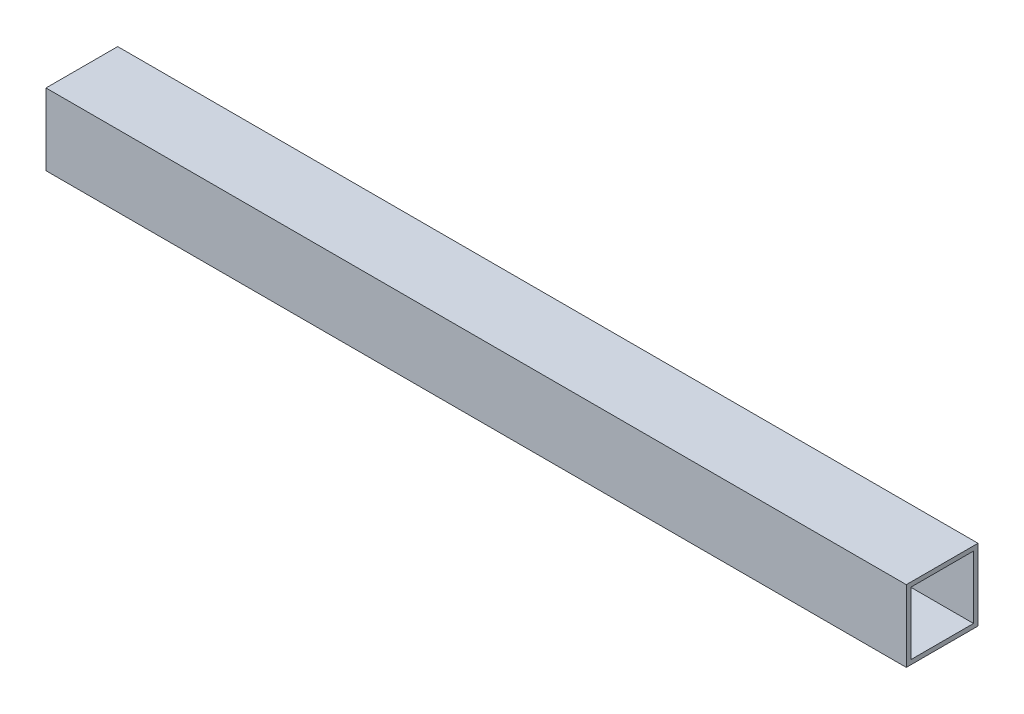
ISO-10303-21;
HEADER;
FILE_DESCRIPTION(('STEP AP214'),'2;1');
FILE_NAME('part.step','',(''),(''),'','','');
FILE_SCHEMA(('AUTOMOTIVE_DESIGN { 1 0 10303 214 1 1 1 1 }'));
ENDSEC;
DATA;
#1=APPLICATION_CONTEXT('core data for automotive mechanical design processes');
#2=APPLICATION_PROTOCOL_DEFINITION('international standard','automotive_design',2000,#1);
#3=PRODUCT_CONTEXT('',#1,'mechanical');
#4=PRODUCT('Part','Part','',(#3));
#5=PRODUCT_RELATED_PRODUCT_CATEGORY('part','',(#4));
#6=PRODUCT_DEFINITION_FORMATION('','',#4);
#7=PRODUCT_DEFINITION_CONTEXT('part definition',#1,'design');
#8=PRODUCT_DEFINITION('design','',#6,#7);
#9=PRODUCT_DEFINITION_SHAPE('','',#8);
#10=(LENGTH_UNIT() NAMED_UNIT(*) SI_UNIT(.MILLI.,.METRE.));
#11=(NAMED_UNIT(*) PLANE_ANGLE_UNIT() SI_UNIT($,.RADIAN.));
#12=(NAMED_UNIT(*) SI_UNIT($,.STERADIAN.) SOLID_ANGLE_UNIT());
#13=UNCERTAINTY_MEASURE_WITH_UNIT(LENGTH_MEASURE(1.E-05),#10,'distance_accuracy_value','');
#14=(GEOMETRIC_REPRESENTATION_CONTEXT(3) GLOBAL_UNCERTAINTY_ASSIGNED_CONTEXT((#13)) GLOBAL_UNIT_ASSIGNED_CONTEXT((#10,
#11,#12)) REPRESENTATION_CONTEXT('',''));
#15=CARTESIAN_POINT('',(0.,0.,0.));
#16=DIRECTION('',(0.,0.,1.));
#17=DIRECTION('',(1.,0.,0.));
#18=AXIS2_PLACEMENT_3D('',#15,#16,#17);
#19=CARTESIAN_POINT('',(304.8,0.,0.));
#20=DIRECTION('',(1.,0.,0.));
#21=DIRECTION('',(0.,0.,-1.));
#22=AXIS2_PLACEMENT_3D('',#19,#20,#21);
#23=PLANE('',#22);
#24=DIRECTION('',(0.,1.,0.));
#25=VECTOR('',#24,1.);
#26=CARTESIAN_POINT('',(304.8,12.7,-12.7));
#27=LINE('',#26,#25);
#28=CARTESIAN_POINT('',(304.8,-12.7,-12.7));
#29=VERTEX_POINT('',#28);
#30=CARTESIAN_POINT('',(304.8,12.7,-12.7));
#31=VERTEX_POINT('',#30);
#32=EDGE_CURVE('E177',#29,#31,#27,.T.);
#33=ORIENTED_EDGE('',*,*,#32,.T.);
#34=DIRECTION('',(0.,0.,1.));
#35=VECTOR('',#34,1.);
#36=CARTESIAN_POINT('',(304.8,12.7,12.7));
#37=LINE('',#36,#35);
#38=CARTESIAN_POINT('',(304.8,12.7,12.7));
#39=VERTEX_POINT('',#38);
#40=EDGE_CURVE('E181',#31,#39,#37,.T.);
#41=ORIENTED_EDGE('',*,*,#40,.T.);
#42=DIRECTION('',(0.,-1.,0.));
#43=VECTOR('',#42,1.);
#44=CARTESIAN_POINT('',(304.8,12.7,12.7));
#45=LINE('',#44,#43);
#46=CARTESIAN_POINT('',(304.8,-12.7,12.7));
#47=VERTEX_POINT('',#46);
#48=EDGE_CURVE('E185',#39,#47,#45,.T.);
#49=ORIENTED_EDGE('',*,*,#48,.T.);
#50=DIRECTION('',(0.,0.,-1.));
#51=VECTOR('',#50,1.);
#52=CARTESIAN_POINT('',(304.8,-12.7,12.7));
#53=LINE('',#52,#51);
#54=EDGE_CURVE('E188',#47,#29,#53,.T.);
#55=ORIENTED_EDGE('',*,*,#54,.T.);
#56=EDGE_LOOP('',(#33,#41,#49,#55));
#57=FACE_BOUND('',#56,.T.);
#58=DIRECTION('',(0.,0.,1.));
#59=VECTOR('',#58,1.);
#60=CARTESIAN_POINT('',(304.8,11.1125,12.7));
#61=LINE('',#60,#59);
#62=CARTESIAN_POINT('',(304.8,11.1125,-11.1125));
#63=VERTEX_POINT('',#62);
#64=CARTESIAN_POINT('',(304.8,11.1125,11.1125));
#65=VERTEX_POINT('',#64);
#66=EDGE_CURVE('E138',#63,#65,#61,.T.);
#67=ORIENTED_EDGE('',*,*,#66,.F.);
#68=DIRECTION('',(0.,1.,0.));
#69=VECTOR('',#68,1.);
#70=CARTESIAN_POINT('',(304.8,12.7,-11.1125));
#71=LINE('',#70,#69);
#72=CARTESIAN_POINT('',(304.8,-11.1125,-11.1125));
#73=VERTEX_POINT('',#72);
#74=EDGE_CURVE('E129',#73,#63,#71,.T.);
#75=ORIENTED_EDGE('',*,*,#74,.F.);
#76=DIRECTION('',(0.,0.,-1.));
#77=VECTOR('',#76,1.);
#78=CARTESIAN_POINT('',(304.8,-11.1125,12.7));
#79=LINE('',#78,#77);
#80=CARTESIAN_POINT('',(304.8,-11.1125,11.1125));
#81=VERTEX_POINT('',#80);
#82=EDGE_CURVE('E155',#81,#73,#79,.T.);
#83=ORIENTED_EDGE('',*,*,#82,.F.);
#84=DIRECTION('',(0.,-1.,0.));
#85=VECTOR('',#84,1.);
#86=CARTESIAN_POINT('',(304.8,12.7,11.1125));
#87=LINE('',#86,#85);
#88=EDGE_CURVE('E151',#65,#81,#87,.T.);
#89=ORIENTED_EDGE('',*,*,#88,.F.);
#90=EDGE_LOOP('',(#67,#75,#83,#89));
#91=FACE_BOUND('',#90,.T.);
#92=ADVANCED_FACE('F63',(#57,#91),#23,.T.);
#93=CARTESIAN_POINT('',(0.,0.,0.));
#94=DIRECTION('',(1.,0.,0.));
#95=DIRECTION('',(0.,0.,-1.));
#96=AXIS2_PLACEMENT_3D('',#93,#94,#95);
#97=PLANE('',#96);
#98=DIRECTION('',(0.,1.,0.));
#99=VECTOR('',#98,1.);
#100=CARTESIAN_POINT('',(0.,12.7,-12.7));
#101=LINE('',#100,#99);
#102=CARTESIAN_POINT('',(0.,-12.7,-12.7));
#103=VERTEX_POINT('',#102);
#104=CARTESIAN_POINT('',(0.,12.7,-12.7));
#105=VERTEX_POINT('',#104);
#106=EDGE_CURVE('E147',#103,#105,#101,.T.);
#107=ORIENTED_EDGE('',*,*,#106,.F.);
#108=DIRECTION('',(0.,0.,-1.));
#109=VECTOR('',#108,1.);
#110=CARTESIAN_POINT('',(0.,-12.7,12.7));
#111=LINE('',#110,#109);
#112=CARTESIAN_POINT('',(0.,-12.7,12.7));
#113=VERTEX_POINT('',#112);
#114=EDGE_CURVE('E182',#113,#103,#111,.T.);
#115=ORIENTED_EDGE('',*,*,#114,.F.);
#116=DIRECTION('',(0.,-1.,0.));
#117=VECTOR('',#116,1.);
#118=CARTESIAN_POINT('',(0.,12.7,12.7));
#119=LINE('',#118,#117);
#120=CARTESIAN_POINT('',(0.,12.7,12.7));
#121=VERTEX_POINT('',#120);
#122=EDGE_CURVE('E198',#121,#113,#119,.T.);
#123=ORIENTED_EDGE('',*,*,#122,.F.);
#124=DIRECTION('',(0.,0.,1.));
#125=VECTOR('',#124,1.);
#126=CARTESIAN_POINT('',(0.,12.7,12.7));
#127=LINE('',#126,#125);
#128=EDGE_CURVE('E195',#105,#121,#127,.T.);
#129=ORIENTED_EDGE('',*,*,#128,.F.);
#130=EDGE_LOOP('',(#107,#115,#123,#129));
#131=FACE_BOUND('',#130,.T.);
#132=DIRECTION('',(0.,1.,0.));
#133=VECTOR('',#132,1.);
#134=CARTESIAN_POINT('',(0.,12.7,-11.1125));
#135=LINE('',#134,#133);
#136=CARTESIAN_POINT('',(0.,-11.1125,-11.1125));
#137=VERTEX_POINT('',#136);
#138=CARTESIAN_POINT('',(0.,11.1125,-11.1125));
#139=VERTEX_POINT('',#138);
#140=EDGE_CURVE('E87',#137,#139,#135,.T.);
#141=ORIENTED_EDGE('',*,*,#140,.T.);
#142=DIRECTION('',(0.,0.,1.));
#143=VECTOR('',#142,1.);
#144=CARTESIAN_POINT('',(0.,11.1125,12.7));
#145=LINE('',#144,#143);
#146=CARTESIAN_POINT('',(0.,11.1125,11.1125));
#147=VERTEX_POINT('',#146);
#148=EDGE_CURVE('E145',#139,#147,#145,.T.);
#149=ORIENTED_EDGE('',*,*,#148,.T.);
#150=DIRECTION('',(0.,-1.,0.));
#151=VECTOR('',#150,1.);
#152=CARTESIAN_POINT('',(0.,12.7,11.1125));
#153=LINE('',#152,#151);
#154=CARTESIAN_POINT('',(0.,-11.1125,11.1125));
#155=VERTEX_POINT('',#154);
#156=EDGE_CURVE('E164',#147,#155,#153,.T.);
#157=ORIENTED_EDGE('',*,*,#156,.T.);
#158=DIRECTION('',(0.,0.,-1.));
#159=VECTOR('',#158,1.);
#160=CARTESIAN_POINT('',(0.,-11.1125,12.7));
#161=LINE('',#160,#159);
#162=EDGE_CURVE('E139',#155,#137,#161,.T.);
#163=ORIENTED_EDGE('',*,*,#162,.T.);
#164=EDGE_LOOP('',(#141,#149,#157,#163));
#165=FACE_BOUND('',#164,.T.);
#166=ADVANCED_FACE('F221',(#131,#165),#97,.F.);
#167=CARTESIAN_POINT('',(304.8,12.7,-12.7));
#168=DIRECTION('',(0.,0.,1.));
#169=DIRECTION('',(0.,-1.,0.));
#170=AXIS2_PLACEMENT_3D('',#167,#168,#169);
#171=PLANE('',#170);
#172=ORIENTED_EDGE('',*,*,#106,.T.);
#173=DIRECTION('',(-1.,0.,0.));
#174=VECTOR('',#173,1.);
#175=CARTESIAN_POINT('',(304.8,12.7,-12.7));
#176=LINE('',#175,#174);
#177=EDGE_CURVE('E12',#31,#105,#176,.T.);
#178=ORIENTED_EDGE('',*,*,#177,.F.);
#179=ORIENTED_EDGE('',*,*,#32,.F.);
#180=DIRECTION('',(-1.,0.,0.));
#181=VECTOR('',#180,1.);
#182=CARTESIAN_POINT('',(304.8,-12.7,-12.7));
#183=LINE('',#182,#181);
#184=EDGE_CURVE('E191',#29,#103,#183,.T.);
#185=ORIENTED_EDGE('',*,*,#184,.T.);
#186=EDGE_LOOP('',(#172,#178,#179,#185));
#187=FACE_BOUND('',#186,.T.);
#188=ADVANCED_FACE('F65',(#187),#171,.F.);
#189=CARTESIAN_POINT('',(304.8,12.7,12.7));
#190=DIRECTION('',(0.,-1.,0.));
#191=DIRECTION('',(0.,0.,-1.));
#192=AXIS2_PLACEMENT_3D('',#189,#190,#191);
#193=PLANE('',#192);
#194=ORIENTED_EDGE('',*,*,#128,.T.);
#195=DIRECTION('',(-1.,0.,0.));
#196=VECTOR('',#195,1.);
#197=CARTESIAN_POINT('',(304.8,12.7,12.7));
#198=LINE('',#197,#196);
#199=EDGE_CURVE('E72',#39,#121,#198,.T.);
#200=ORIENTED_EDGE('',*,*,#199,.F.);
#201=ORIENTED_EDGE('',*,*,#40,.F.);
#202=ORIENTED_EDGE('',*,*,#177,.T.);
#203=EDGE_LOOP('',(#194,#200,#201,#202));
#204=FACE_BOUND('',#203,.T.);
#205=ADVANCED_FACE('F231',(#204),#193,.F.);
#206=CARTESIAN_POINT('',(304.8,12.7,12.7));
#207=DIRECTION('',(0.,0.,-1.));
#208=DIRECTION('',(0.,1.,0.));
#209=AXIS2_PLACEMENT_3D('',#206,#207,#208);
#210=PLANE('',#209);
#211=ORIENTED_EDGE('',*,*,#122,.T.);
#212=DIRECTION('',(-1.,0.,0.));
#213=VECTOR('',#212,1.);
#214=CARTESIAN_POINT('',(304.8,-12.7,12.7));
#215=LINE('',#214,#213);
#216=EDGE_CURVE('E206',#47,#113,#215,.T.);
#217=ORIENTED_EDGE('',*,*,#216,.F.);
#218=ORIENTED_EDGE('',*,*,#48,.F.);
#219=ORIENTED_EDGE('',*,*,#199,.T.);
#220=EDGE_LOOP('',(#211,#217,#218,#219));
#221=FACE_BOUND('',#220,.T.);
#222=ADVANCED_FACE('F215',(#221),#210,.F.);
#223=CARTESIAN_POINT('',(304.8,-12.7,12.7));
#224=DIRECTION('',(0.,1.,0.));
#225=DIRECTION('',(0.,0.,1.));
#226=AXIS2_PLACEMENT_3D('',#223,#224,#225);
#227=PLANE('',#226);
#228=ORIENTED_EDGE('',*,*,#114,.T.);
#229=ORIENTED_EDGE('',*,*,#184,.F.);
#230=ORIENTED_EDGE('',*,*,#54,.F.);
#231=ORIENTED_EDGE('',*,*,#216,.T.);
#232=EDGE_LOOP('',(#228,#229,#230,#231));
#233=FACE_BOUND('',#232,.T.);
#234=ADVANCED_FACE('F225',(#233),#227,.F.);
#235=CARTESIAN_POINT('',(304.8,12.7,-11.1125));
#236=DIRECTION('',(0.,0.,1.));
#237=DIRECTION('',(0.,-1.,0.));
#238=AXIS2_PLACEMENT_3D('',#235,#236,#237);
#239=PLANE('',#238);
#240=ORIENTED_EDGE('',*,*,#140,.F.);
#241=DIRECTION('',(-1.,0.,0.));
#242=VECTOR('',#241,1.);
#243=CARTESIAN_POINT('',(304.8,-11.1125,-11.1125));
#244=LINE('',#243,#242);
#245=EDGE_CURVE('E133',#73,#137,#244,.T.);
#246=ORIENTED_EDGE('',*,*,#245,.F.);
#247=ORIENTED_EDGE('',*,*,#74,.T.);
#248=DIRECTION('',(-1.,0.,0.));
#249=VECTOR('',#248,1.);
#250=CARTESIAN_POINT('',(304.8,11.1125,-11.1125));
#251=LINE('',#250,#249);
#252=EDGE_CURVE('E132',#63,#139,#251,.T.);
#253=ORIENTED_EDGE('',*,*,#252,.T.);
#254=EDGE_LOOP('',(#240,#246,#247,#253));
#255=FACE_BOUND('',#254,.T.);
#256=ADVANCED_FACE('F131',(#255),#239,.T.);
#257=CARTESIAN_POINT('',(304.8,11.1125,12.7));
#258=DIRECTION('',(0.,-1.,0.));
#259=DIRECTION('',(0.,0.,-1.));
#260=AXIS2_PLACEMENT_3D('',#257,#258,#259);
#261=PLANE('',#260);
#262=ORIENTED_EDGE('',*,*,#148,.F.);
#263=ORIENTED_EDGE('',*,*,#252,.F.);
#264=ORIENTED_EDGE('',*,*,#66,.T.);
#265=DIRECTION('',(-1.,0.,0.));
#266=VECTOR('',#265,1.);
#267=CARTESIAN_POINT('',(304.8,11.1125,11.1125));
#268=LINE('',#267,#266);
#269=EDGE_CURVE('E148',#65,#147,#268,.T.);
#270=ORIENTED_EDGE('',*,*,#269,.T.);
#271=EDGE_LOOP('',(#262,#263,#264,#270));
#272=FACE_BOUND('',#271,.T.);
#273=ADVANCED_FACE('F142',(#272),#261,.T.);
#274=CARTESIAN_POINT('',(304.8,12.7,11.1125));
#275=DIRECTION('',(0.,0.,-1.));
#276=DIRECTION('',(0.,1.,0.));
#277=AXIS2_PLACEMENT_3D('',#274,#275,#276);
#278=PLANE('',#277);
#279=ORIENTED_EDGE('',*,*,#156,.F.);
#280=ORIENTED_EDGE('',*,*,#269,.F.);
#281=ORIENTED_EDGE('',*,*,#88,.T.);
#282=DIRECTION('',(-1.,0.,0.));
#283=VECTOR('',#282,1.);
#284=CARTESIAN_POINT('',(304.8,-11.1125,11.1125));
#285=LINE('',#284,#283);
#286=EDGE_CURVE('E79',#81,#155,#285,.T.);
#287=ORIENTED_EDGE('',*,*,#286,.T.);
#288=EDGE_LOOP('',(#279,#280,#281,#287));
#289=FACE_BOUND('',#288,.T.);
#290=ADVANCED_FACE('F254',(#289),#278,.T.);
#291=CARTESIAN_POINT('',(304.8,-11.1125,12.7));
#292=DIRECTION('',(0.,1.,0.));
#293=DIRECTION('',(0.,0.,1.));
#294=AXIS2_PLACEMENT_3D('',#291,#292,#293);
#295=PLANE('',#294);
#296=ORIENTED_EDGE('',*,*,#162,.F.);
#297=ORIENTED_EDGE('',*,*,#286,.F.);
#298=ORIENTED_EDGE('',*,*,#82,.T.);
#299=ORIENTED_EDGE('',*,*,#245,.T.);
#300=EDGE_LOOP('',(#296,#297,#298,#299));
#301=FACE_BOUND('',#300,.T.);
#302=ADVANCED_FACE('F258',(#301),#295,.T.);
#303=CLOSED_SHELL('',(#92,#166,#188,#205,#222,#234,#256,#273,#290,#302));
#304=MANIFOLD_SOLID_BREP('B2',#303);
#305=ADVANCED_BREP_SHAPE_REPRESENTATION('',(#18,#304),#14);
#306=SHAPE_DEFINITION_REPRESENTATION(#9,#305);
ENDSEC;
END-ISO-10303-21;
